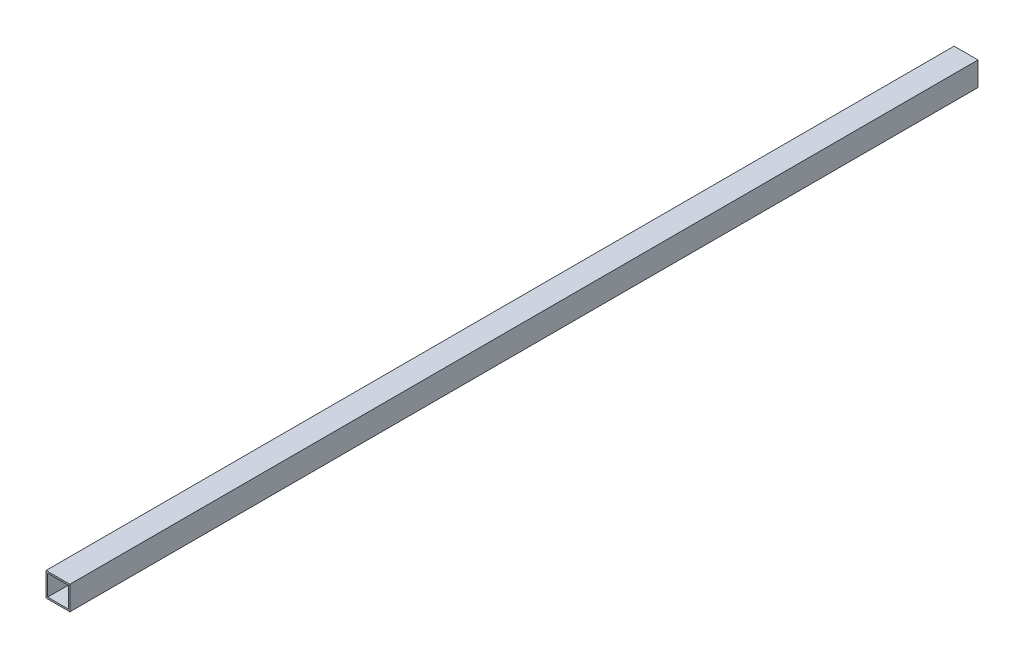
ISO-10303-21;
HEADER;
FILE_DESCRIPTION(('STEP AP214'),'2;1');
FILE_NAME('part.step','',(''),(''),'','','');
FILE_SCHEMA(('AUTOMOTIVE_DESIGN { 1 0 10303 214 1 1 1 1 }'));
ENDSEC;
DATA;
#1=APPLICATION_CONTEXT('core data for automotive mechanical design processes');
#2=APPLICATION_PROTOCOL_DEFINITION('international standard','automotive_design',2000,#1);
#3=PRODUCT_CONTEXT('',#1,'mechanical');
#4=PRODUCT('Part','Part','',(#3));
#5=PRODUCT_RELATED_PRODUCT_CATEGORY('part','',(#4));
#6=PRODUCT_DEFINITION_FORMATION('','',#4);
#7=PRODUCT_DEFINITION_CONTEXT('part definition',#1,'design');
#8=PRODUCT_DEFINITION('design','',#6,#7);
#9=PRODUCT_DEFINITION_SHAPE('','',#8);
#10=(LENGTH_UNIT() NAMED_UNIT(*) SI_UNIT(.MILLI.,.METRE.));
#11=(NAMED_UNIT(*) PLANE_ANGLE_UNIT() SI_UNIT($,.RADIAN.));
#12=(NAMED_UNIT(*) SI_UNIT($,.STERADIAN.) SOLID_ANGLE_UNIT());
#13=UNCERTAINTY_MEASURE_WITH_UNIT(LENGTH_MEASURE(1.E-05),#10,'distance_accuracy_value','');
#14=(GEOMETRIC_REPRESENTATION_CONTEXT(3) GLOBAL_UNCERTAINTY_ASSIGNED_CONTEXT((#13)) GLOBAL_UNIT_ASSIGNED_CONTEXT((#10,
#11,#12)) REPRESENTATION_CONTEXT('',''));
#15=CARTESIAN_POINT('',(0.,0.,0.));
#16=DIRECTION('',(0.,0.,1.));
#17=DIRECTION('',(1.,0.,0.));
#18=AXIS2_PLACEMENT_3D('',#15,#16,#17);
#19=CARTESIAN_POINT('',(-30.,30.,1140.));
#20=DIRECTION('',(1.,0.,0.));
#21=DIRECTION('',(0.,0.,-1.));
#22=AXIS2_PLACEMENT_3D('',#19,#20,#21);
#23=PLANE('',#22);
#24=DIRECTION('',(0.,0.,-1.));
#25=VECTOR('',#24,1.);
#26=CARTESIAN_POINT('',(-30.,-30.,1140.));
#27=LINE('',#26,#25);
#28=CARTESIAN_POINT('',(-30.,-30.,1140.));
#29=VERTEX_POINT('',#28);
#30=CARTESIAN_POINT('',(-30.,-30.,-1140.));
#31=VERTEX_POINT('',#30);
#32=EDGE_CURVE('E98',#29,#31,#27,.T.);
#33=ORIENTED_EDGE('',*,*,#32,.F.);
#34=DIRECTION('',(0.,-1.,0.));
#35=VECTOR('',#34,1.);
#36=CARTESIAN_POINT('',(-30.,30.,1140.));
#37=LINE('',#36,#35);
#38=CARTESIAN_POINT('',(-30.,30.,1140.));
#39=VERTEX_POINT('',#38);
#40=EDGE_CURVE('E87',#39,#29,#37,.T.);
#41=ORIENTED_EDGE('',*,*,#40,.F.);
#42=DIRECTION('',(0.,0.,-1.));
#43=VECTOR('',#42,1.);
#44=CARTESIAN_POINT('',(-30.,30.,1140.));
#45=LINE('',#44,#43);
#46=CARTESIAN_POINT('',(-30.,30.,-1140.));
#47=VERTEX_POINT('',#46);
#48=EDGE_CURVE('E103',#39,#47,#45,.T.);
#49=ORIENTED_EDGE('',*,*,#48,.T.);
#50=DIRECTION('',(0.,-1.,0.));
#51=VECTOR('',#50,1.);
#52=CARTESIAN_POINT('',(-30.,30.,-1140.));
#53=LINE('',#52,#51);
#54=EDGE_CURVE('E99',#47,#31,#53,.T.);
#55=ORIENTED_EDGE('',*,*,#54,.T.);
#56=EDGE_LOOP('',(#33,#41,#49,#55));
#57=FACE_BOUND('',#56,.T.);
#58=ADVANCED_FACE('F35',(#57),#23,.F.);
#59=CARTESIAN_POINT('',(-30.,-30.,1140.));
#60=DIRECTION('',(0.,1.,0.));
#61=DIRECTION('',(0.,0.,1.));
#62=AXIS2_PLACEMENT_3D('',#59,#60,#61);
#63=PLANE('',#62);
#64=DIRECTION('',(0.,0.,-1.));
#65=VECTOR('',#64,1.);
#66=CARTESIAN_POINT('',(30.,-30.,1140.));
#67=LINE('',#66,#65);
#68=CARTESIAN_POINT('',(30.,-30.,1140.));
#69=VERTEX_POINT('',#68);
#70=CARTESIAN_POINT('',(30.,-30.,-1140.));
#71=VERTEX_POINT('',#70);
#72=EDGE_CURVE('E102',#69,#71,#67,.T.);
#73=ORIENTED_EDGE('',*,*,#72,.F.);
#74=DIRECTION('',(1.,0.,0.));
#75=VECTOR('',#74,1.);
#76=CARTESIAN_POINT('',(-30.,-30.,1140.));
#77=LINE('',#76,#75);
#78=EDGE_CURVE('E84',#29,#69,#77,.T.);
#79=ORIENTED_EDGE('',*,*,#78,.F.);
#80=ORIENTED_EDGE('',*,*,#32,.T.);
#81=DIRECTION('',(1.,0.,0.));
#82=VECTOR('',#81,1.);
#83=CARTESIAN_POINT('',(-30.,-30.,-1140.));
#84=LINE('',#83,#82);
#85=EDGE_CURVE('E125',#31,#71,#84,.T.);
#86=ORIENTED_EDGE('',*,*,#85,.T.);
#87=EDGE_LOOP('',(#73,#79,#80,#86));
#88=FACE_BOUND('',#87,.T.);
#89=ADVANCED_FACE('F105',(#88),#63,.F.);
#90=CARTESIAN_POINT('',(30.,30.,1140.));
#91=DIRECTION('',(-1.,0.,0.));
#92=DIRECTION('',(0.,0.,1.));
#93=AXIS2_PLACEMENT_3D('',#90,#91,#92);
#94=PLANE('',#93);
#95=DIRECTION('',(0.,0.,-1.));
#96=VECTOR('',#95,1.);
#97=CARTESIAN_POINT('',(30.,30.,1140.));
#98=LINE('',#97,#96);
#99=CARTESIAN_POINT('',(30.,30.,1140.));
#100=VERTEX_POINT('',#99);
#101=CARTESIAN_POINT('',(30.,30.,-1140.));
#102=VERTEX_POINT('',#101);
#103=EDGE_CURVE('E39',#100,#102,#98,.T.);
#104=ORIENTED_EDGE('',*,*,#103,.F.);
#105=DIRECTION('',(0.,1.,0.));
#106=VECTOR('',#105,1.);
#107=CARTESIAN_POINT('',(30.,30.,1140.));
#108=LINE('',#107,#106);
#109=EDGE_CURVE('E108',#69,#100,#108,.T.);
#110=ORIENTED_EDGE('',*,*,#109,.F.);
#111=ORIENTED_EDGE('',*,*,#72,.T.);
#112=DIRECTION('',(0.,1.,0.));
#113=VECTOR('',#112,1.);
#114=CARTESIAN_POINT('',(30.,30.,-1140.));
#115=LINE('',#114,#113);
#116=EDGE_CURVE('E112',#71,#102,#115,.T.);
#117=ORIENTED_EDGE('',*,*,#116,.T.);
#118=EDGE_LOOP('',(#104,#110,#111,#117));
#119=FACE_BOUND('',#118,.T.);
#120=ADVANCED_FACE('F123',(#119),#94,.F.);
#121=CARTESIAN_POINT('',(-30.,30.,1140.));
#122=DIRECTION('',(0.,-1.,0.));
#123=DIRECTION('',(0.,0.,-1.));
#124=AXIS2_PLACEMENT_3D('',#121,#122,#123);
#125=PLANE('',#124);
#126=DIRECTION('',(-1.,0.,0.));
#127=VECTOR('',#126,1.);
#128=CARTESIAN_POINT('',(-30.,30.,-1140.));
#129=LINE('',#128,#127);
#130=EDGE_CURVE('E122',#102,#47,#129,.T.);
#131=ORIENTED_EDGE('',*,*,#130,.T.);
#132=ORIENTED_EDGE('',*,*,#48,.F.);
#133=DIRECTION('',(-1.,0.,0.));
#134=VECTOR('',#133,1.);
#135=CARTESIAN_POINT('',(-30.,30.,1140.));
#136=LINE('',#135,#134);
#137=EDGE_CURVE('E91',#100,#39,#136,.T.);
#138=ORIENTED_EDGE('',*,*,#137,.F.);
#139=ORIENTED_EDGE('',*,*,#103,.T.);
#140=EDGE_LOOP('',(#131,#132,#138,#139));
#141=FACE_BOUND('',#140,.T.);
#142=ADVANCED_FACE('F37',(#141),#125,.F.);
#143=CARTESIAN_POINT('',(0.,0.,1140.));
#144=DIRECTION('',(0.,0.,1.));
#145=DIRECTION('',(1.,0.,0.));
#146=AXIS2_PLACEMENT_3D('',#143,#144,#145);
#147=PLANE('',#146);
#148=DIRECTION('',(0.,-1.,0.));
#149=VECTOR('',#148,1.);
#150=CARTESIAN_POINT('',(-26.,26.,1140.));
#151=LINE('',#150,#149);
#152=CARTESIAN_POINT('',(-26.,-26.,1140.));
#153=VERTEX_POINT('',#152);
#154=CARTESIAN_POINT('',(-26.,26.,1140.));
#155=VERTEX_POINT('',#154);
#156=EDGE_CURVE('E130',#153,#155,#151,.F.);
#157=ORIENTED_EDGE('',*,*,#156,.T.);
#158=DIRECTION('',(-1.,0.,0.));
#159=VECTOR('',#158,1.);
#160=CARTESIAN_POINT('',(-26.,26.,1140.));
#161=LINE('',#160,#159);
#162=CARTESIAN_POINT('',(26.,26.,1140.));
#163=VERTEX_POINT('',#162);
#164=EDGE_CURVE('E126',#155,#163,#161,.F.);
#165=ORIENTED_EDGE('',*,*,#164,.T.);
#166=DIRECTION('',(0.,1.,0.));
#167=VECTOR('',#166,1.);
#168=CARTESIAN_POINT('',(26.,26.,1140.));
#169=LINE('',#168,#167);
#170=CARTESIAN_POINT('',(26.,-26.,1140.));
#171=VERTEX_POINT('',#170);
#172=EDGE_CURVE('E144',#163,#171,#169,.F.);
#173=ORIENTED_EDGE('',*,*,#172,.T.);
#174=DIRECTION('',(1.,0.,0.));
#175=VECTOR('',#174,1.);
#176=CARTESIAN_POINT('',(-26.,-26.,1140.));
#177=LINE('',#176,#175);
#178=EDGE_CURVE('E134',#171,#153,#177,.F.);
#179=ORIENTED_EDGE('',*,*,#178,.T.);
#180=EDGE_LOOP('',(#157,#165,#173,#179));
#181=FACE_BOUND('',#180,.T.);
#182=ORIENTED_EDGE('',*,*,#40,.T.);
#183=ORIENTED_EDGE('',*,*,#78,.T.);
#184=ORIENTED_EDGE('',*,*,#109,.T.);
#185=ORIENTED_EDGE('',*,*,#137,.T.);
#186=EDGE_LOOP('',(#182,#183,#184,#185));
#187=FACE_BOUND('',#186,.T.);
#188=ADVANCED_FACE('F89',(#181,#187),#147,.T.);
#189=CARTESIAN_POINT('',(0.,0.,-1140.));
#190=DIRECTION('',(0.,0.,1.));
#191=DIRECTION('',(1.,0.,0.));
#192=AXIS2_PLACEMENT_3D('',#189,#190,#191);
#193=PLANE('',#192);
#194=DIRECTION('',(0.,-1.,0.));
#195=VECTOR('',#194,1.);
#196=CARTESIAN_POINT('',(-26.,26.,-1140.));
#197=LINE('',#196,#195);
#198=CARTESIAN_POINT('',(-26.,-26.,-1140.));
#199=VERTEX_POINT('',#198);
#200=CARTESIAN_POINT('',(-26.,26.,-1140.));
#201=VERTEX_POINT('',#200);
#202=EDGE_CURVE('E11',#199,#201,#197,.F.);
#203=ORIENTED_EDGE('',*,*,#202,.F.);
#204=DIRECTION('',(1.,0.,0.));
#205=VECTOR('',#204,1.);
#206=CARTESIAN_POINT('',(-26.,-26.,-1140.));
#207=LINE('',#206,#205);
#208=CARTESIAN_POINT('',(26.,-26.,-1140.));
#209=VERTEX_POINT('',#208);
#210=EDGE_CURVE('E45',#209,#199,#207,.F.);
#211=ORIENTED_EDGE('',*,*,#210,.F.);
#212=DIRECTION('',(0.,1.,0.));
#213=VECTOR('',#212,1.);
#214=CARTESIAN_POINT('',(26.,26.,-1140.));
#215=LINE('',#214,#213);
#216=CARTESIAN_POINT('',(26.,26.,-1140.));
#217=VERTEX_POINT('',#216);
#218=EDGE_CURVE('E141',#217,#209,#215,.F.);
#219=ORIENTED_EDGE('',*,*,#218,.F.);
#220=DIRECTION('',(-1.,0.,0.));
#221=VECTOR('',#220,1.);
#222=CARTESIAN_POINT('',(-26.,26.,-1140.));
#223=LINE('',#222,#221);
#224=EDGE_CURVE('E138',#201,#217,#223,.F.);
#225=ORIENTED_EDGE('',*,*,#224,.F.);
#226=EDGE_LOOP('',(#203,#211,#219,#225));
#227=FACE_BOUND('',#226,.T.);
#228=ORIENTED_EDGE('',*,*,#54,.F.);
#229=ORIENTED_EDGE('',*,*,#130,.F.);
#230=ORIENTED_EDGE('',*,*,#116,.F.);
#231=ORIENTED_EDGE('',*,*,#85,.F.);
#232=EDGE_LOOP('',(#228,#229,#230,#231));
#233=FACE_BOUND('',#232,.T.);
#234=ADVANCED_FACE('F191',(#227,#233),#193,.F.);
#235=CARTESIAN_POINT('',(-26.,26.,1140.));
#236=DIRECTION('',(0.,1.,0.));
#237=DIRECTION('',(0.,0.,1.));
#238=AXIS2_PLACEMENT_3D('',#235,#236,#237);
#239=PLANE('',#238);
#240=DIRECTION('',(0.,0.,-1.));
#241=VECTOR('',#240,1.);
#242=CARTESIAN_POINT('',(26.,26.,1140.));
#243=LINE('',#242,#241);
#244=EDGE_CURVE('E146',#163,#217,#243,.T.);
#245=ORIENTED_EDGE('',*,*,#244,.F.);
#246=ORIENTED_EDGE('',*,*,#164,.F.);
#247=DIRECTION('',(0.,0.,-1.));
#248=VECTOR('',#247,1.);
#249=CARTESIAN_POINT('',(-26.,26.,1140.));
#250=LINE('',#249,#248);
#251=EDGE_CURVE('E133',#155,#201,#250,.T.);
#252=ORIENTED_EDGE('',*,*,#251,.T.);
#253=ORIENTED_EDGE('',*,*,#224,.T.);
#254=EDGE_LOOP('',(#245,#246,#252,#253));
#255=FACE_BOUND('',#254,.T.);
#256=ADVANCED_FACE('F168',(#255),#239,.F.);
#257=CARTESIAN_POINT('',(26.,26.,1140.));
#258=DIRECTION('',(1.,0.,0.));
#259=DIRECTION('',(0.,0.,-1.));
#260=AXIS2_PLACEMENT_3D('',#257,#258,#259);
#261=PLANE('',#260);
#262=DIRECTION('',(0.,0.,-1.));
#263=VECTOR('',#262,1.);
#264=CARTESIAN_POINT('',(26.,-26.,1140.));
#265=LINE('',#264,#263);
#266=EDGE_CURVE('E139',#171,#209,#265,.T.);
#267=ORIENTED_EDGE('',*,*,#266,.F.);
#268=ORIENTED_EDGE('',*,*,#172,.F.);
#269=ORIENTED_EDGE('',*,*,#244,.T.);
#270=ORIENTED_EDGE('',*,*,#218,.T.);
#271=EDGE_LOOP('',(#267,#268,#269,#270));
#272=FACE_BOUND('',#271,.T.);
#273=ADVANCED_FACE('F172',(#272),#261,.F.);
#274=CARTESIAN_POINT('',(-26.,-26.,1140.));
#275=DIRECTION('',(0.,-1.,0.));
#276=DIRECTION('',(0.,0.,-1.));
#277=AXIS2_PLACEMENT_3D('',#274,#275,#276);
#278=PLANE('',#277);
#279=DIRECTION('',(0.,0.,-1.));
#280=VECTOR('',#279,1.);
#281=CARTESIAN_POINT('',(-26.,-26.,1140.));
#282=LINE('',#281,#280);
#283=EDGE_CURVE('E135',#153,#199,#282,.T.);
#284=ORIENTED_EDGE('',*,*,#283,.F.);
#285=ORIENTED_EDGE('',*,*,#178,.F.);
#286=ORIENTED_EDGE('',*,*,#266,.T.);
#287=ORIENTED_EDGE('',*,*,#210,.T.);
#288=EDGE_LOOP('',(#284,#285,#286,#287));
#289=FACE_BOUND('',#288,.T.);
#290=ADVANCED_FACE('F180',(#289),#278,.F.);
#291=CARTESIAN_POINT('',(-26.,26.,1140.));
#292=DIRECTION('',(-1.,0.,0.));
#293=DIRECTION('',(0.,0.,1.));
#294=AXIS2_PLACEMENT_3D('',#291,#292,#293);
#295=PLANE('',#294);
#296=ORIENTED_EDGE('',*,*,#202,.T.);
#297=ORIENTED_EDGE('',*,*,#251,.F.);
#298=ORIENTED_EDGE('',*,*,#156,.F.);
#299=ORIENTED_EDGE('',*,*,#283,.T.);
#300=EDGE_LOOP('',(#296,#297,#298,#299));
#301=FACE_BOUND('',#300,.T.);
#302=ADVANCED_FACE('F179',(#301),#295,.F.);
#303=CLOSED_SHELL('',(#58,#89,#120,#142,#188,#234,#256,#273,#290,#302));
#304=MANIFOLD_SOLID_BREP('B2',#303);
#305=ADVANCED_BREP_SHAPE_REPRESENTATION('',(#18,#304),#14);
#306=SHAPE_DEFINITION_REPRESENTATION(#9,#305);
ENDSEC;
END-ISO-10303-21;
